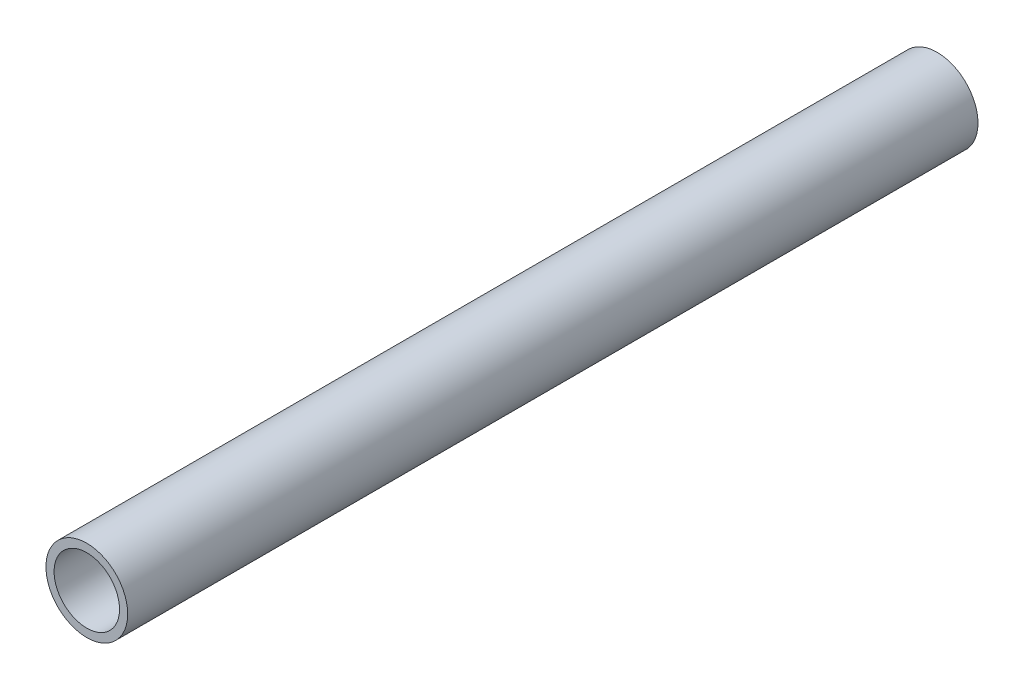
ISO-10303-21;
HEADER;
FILE_DESCRIPTION(('STEP AP214'),'2;1');
FILE_NAME('part.step','',(''),(''),'','','');
FILE_SCHEMA(('AUTOMOTIVE_DESIGN { 1 0 10303 214 1 1 1 1 }'));
ENDSEC;
DATA;
#1=APPLICATION_CONTEXT('core data for automotive mechanical design processes');
#2=APPLICATION_PROTOCOL_DEFINITION('international standard','automotive_design',2000,#1);
#3=PRODUCT_CONTEXT('',#1,'mechanical');
#4=PRODUCT('Part','Part','',(#3));
#5=PRODUCT_RELATED_PRODUCT_CATEGORY('part','',(#4));
#6=PRODUCT_DEFINITION_FORMATION('','',#4);
#7=PRODUCT_DEFINITION_CONTEXT('part definition',#1,'design');
#8=PRODUCT_DEFINITION('design','',#6,#7);
#9=PRODUCT_DEFINITION_SHAPE('','',#8);
#10=(LENGTH_UNIT() NAMED_UNIT(*) SI_UNIT(.MILLI.,.METRE.));
#11=(NAMED_UNIT(*) PLANE_ANGLE_UNIT() SI_UNIT($,.RADIAN.));
#12=(NAMED_UNIT(*) SI_UNIT($,.STERADIAN.) SOLID_ANGLE_UNIT());
#13=UNCERTAINTY_MEASURE_WITH_UNIT(LENGTH_MEASURE(1.E-05),#10,'distance_accuracy_value','');
#14=(GEOMETRIC_REPRESENTATION_CONTEXT(3) GLOBAL_UNCERTAINTY_ASSIGNED_CONTEXT((#13)) GLOBAL_UNIT_ASSIGNED_CONTEXT((#10,
#11,#12)) REPRESENTATION_CONTEXT('',''));
#15=CARTESIAN_POINT('',(0.,0.,0.));
#16=DIRECTION('',(0.,0.,1.));
#17=DIRECTION('',(1.,0.,0.));
#18=AXIS2_PLACEMENT_3D('',#15,#16,#17);
#19=CARTESIAN_POINT('',(0.,0.,26.));
#20=DIRECTION('',(0.,0.,1.));
#21=DIRECTION('',(1.,0.,0.));
#22=AXIS2_PLACEMENT_3D('',#19,#20,#21);
#23=PLANE('',#22);
#24=CARTESIAN_POINT('',(0.,0.,26.));
#25=DIRECTION('',(0.,0.,1.));
#26=DIRECTION('',(1.,0.,0.));
#27=AXIS2_PLACEMENT_3D('',#24,#25,#26);
#28=CIRCLE('',#27,1.25);
#29=CARTESIAN_POINT('',(1.25,0.,26.));
#30=VERTEX_POINT('',#29);
#31=EDGE_CURVE('E10',#30,#30,#28,.T.);
#32=ORIENTED_EDGE('',*,*,#31,.T.);
#33=EDGE_LOOP('',(#32));
#34=FACE_BOUND('',#33,.T.);
#35=CARTESIAN_POINT('',(0.,0.,26.));
#36=DIRECTION('',(0.,0.,1.));
#37=DIRECTION('',(1.,0.,0.));
#38=AXIS2_PLACEMENT_3D('',#35,#36,#37);
#39=CIRCLE('',#38,1.);
#40=CARTESIAN_POINT('',(1.,0.,26.));
#41=VERTEX_POINT('',#40);
#42=EDGE_CURVE('E42',#41,#41,#39,.T.);
#43=ORIENTED_EDGE('',*,*,#42,.F.);
#44=EDGE_LOOP('',(#43));
#45=FACE_BOUND('',#44,.T.);
#46=ADVANCED_FACE('F31',(#34,#45),#23,.T.);
#47=CARTESIAN_POINT('',(0.,0.,0.));
#48=DIRECTION('',(0.,0.,1.));
#49=DIRECTION('',(1.,0.,0.));
#50=AXIS2_PLACEMENT_3D('',#47,#48,#49);
#51=PLANE('',#50);
#52=CARTESIAN_POINT('',(0.,0.,0.));
#53=DIRECTION('',(0.,0.,1.));
#54=DIRECTION('',(1.,0.,0.));
#55=AXIS2_PLACEMENT_3D('',#52,#53,#54);
#56=CIRCLE('',#55,1.25);
#57=CARTESIAN_POINT('',(1.25,0.,0.));
#58=VERTEX_POINT('',#57);
#59=EDGE_CURVE('E35',#58,#58,#56,.T.);
#60=ORIENTED_EDGE('',*,*,#59,.F.);
#61=EDGE_LOOP('',(#60));
#62=FACE_BOUND('',#61,.T.);
#63=CARTESIAN_POINT('',(0.,0.,0.));
#64=DIRECTION('',(0.,0.,1.));
#65=DIRECTION('',(1.,0.,0.));
#66=AXIS2_PLACEMENT_3D('',#63,#64,#65);
#67=CIRCLE('',#66,1.);
#68=CARTESIAN_POINT('',(1.,0.,0.));
#69=VERTEX_POINT('',#68);
#70=EDGE_CURVE('E44',#69,#69,#67,.T.);
#71=ORIENTED_EDGE('',*,*,#70,.T.);
#72=EDGE_LOOP('',(#71));
#73=FACE_BOUND('',#72,.T.);
#74=ADVANCED_FACE('F54',(#62,#73),#51,.F.);
#75=CARTESIAN_POINT('',(0.,0.,26.));
#76=DIRECTION('',(0.,0.,-1.));
#77=DIRECTION('',(-1.,0.,0.));
#78=AXIS2_PLACEMENT_3D('',#75,#76,#77);
#79=CYLINDRICAL_SURFACE('',#78,1.25);
#80=ORIENTED_EDGE('',*,*,#31,.F.);
#81=EDGE_LOOP('',(#80));
#82=FACE_BOUND('',#81,.T.);
#83=ORIENTED_EDGE('',*,*,#59,.T.);
#84=EDGE_LOOP('',(#83));
#85=FACE_BOUND('',#84,.T.);
#86=ADVANCED_FACE('F33',(#82,#85),#79,.T.);
#87=CARTESIAN_POINT('',(0.,0.,26.));
#88=DIRECTION('',(0.,0.,-1.));
#89=DIRECTION('',(-1.,0.,0.));
#90=AXIS2_PLACEMENT_3D('',#87,#88,#89);
#91=CYLINDRICAL_SURFACE('',#90,1.);
#92=ORIENTED_EDGE('',*,*,#42,.T.);
#93=EDGE_LOOP('',(#92));
#94=FACE_BOUND('',#93,.T.);
#95=ORIENTED_EDGE('',*,*,#70,.F.);
#96=EDGE_LOOP('',(#95));
#97=FACE_BOUND('',#96,.T.);
#98=ADVANCED_FACE('F50',(#94,#97),#91,.F.);
#99=CLOSED_SHELL('',(#46,#74,#86,#98));
#100=MANIFOLD_SOLID_BREP('B2',#99);
#101=ADVANCED_BREP_SHAPE_REPRESENTATION('',(#18,#100),#14);
#102=SHAPE_DEFINITION_REPRESENTATION(#9,#101);
ENDSEC;
END-ISO-10303-21;
